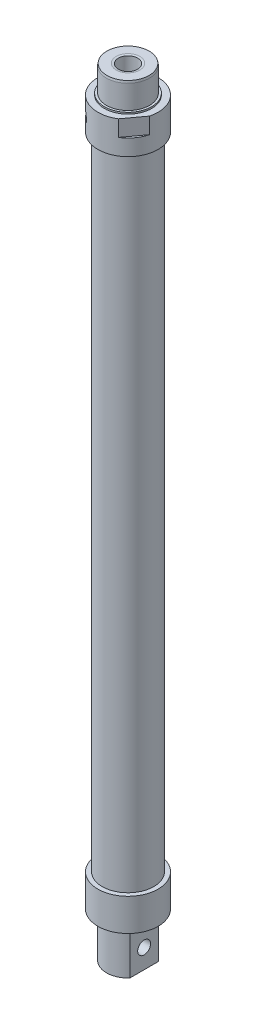
ISO-10303-21;
HEADER;
FILE_DESCRIPTION(('STEP AP214'),'2;1');
FILE_NAME('part.step','',(''),(''),'','','');
FILE_SCHEMA(('AUTOMOTIVE_DESIGN { 1 0 10303 214 1 1 1 1 }'));
ENDSEC;
DATA;
#1=APPLICATION_CONTEXT('core data for automotive mechanical design processes');
#2=APPLICATION_PROTOCOL_DEFINITION('international standard','automotive_design',2000,#1);
#3=PRODUCT_CONTEXT('',#1,'mechanical');
#4=PRODUCT('Part','Part','',(#3));
#5=PRODUCT_RELATED_PRODUCT_CATEGORY('part','',(#4));
#6=PRODUCT_DEFINITION_FORMATION('','',#4);
#7=PRODUCT_DEFINITION_CONTEXT('part definition',#1,'design');
#8=PRODUCT_DEFINITION('design','',#6,#7);
#9=PRODUCT_DEFINITION_SHAPE('','',#8);
#10=(LENGTH_UNIT() NAMED_UNIT(*) SI_UNIT(.MILLI.,.METRE.));
#11=(NAMED_UNIT(*) PLANE_ANGLE_UNIT() SI_UNIT($,.RADIAN.));
#12=(NAMED_UNIT(*) SI_UNIT($,.STERADIAN.) SOLID_ANGLE_UNIT());
#13=UNCERTAINTY_MEASURE_WITH_UNIT(LENGTH_MEASURE(1.E-05),#10,'distance_accuracy_value','');
#14=(GEOMETRIC_REPRESENTATION_CONTEXT(3) GLOBAL_UNCERTAINTY_ASSIGNED_CONTEXT((#13)) GLOBAL_UNIT_ASSIGNED_CONTEXT((#10,
#11,#12)) REPRESENTATION_CONTEXT('',''));
#15=CARTESIAN_POINT('',(0.,0.,0.));
#16=DIRECTION('',(0.,0.,1.));
#17=DIRECTION('',(1.,0.,0.));
#18=AXIS2_PLACEMENT_3D('',#15,#16,#17);
#19=CARTESIAN_POINT('',(0.,-35.75,0.));
#20=DIRECTION('',(0.,1.,0.));
#21=DIRECTION('',(0.,0.,1.));
#22=AXIS2_PLACEMENT_3D('',#19,#20,#21);
#23=CYLINDRICAL_SURFACE('',#22,10.);
#24=CARTESIAN_POINT('',(0.,-35.75,0.));
#25=DIRECTION('',(0.,-1.,0.));
#26=DIRECTION('',(0.,0.,-1.));
#27=AXIS2_PLACEMENT_3D('',#24,#25,#26);
#28=CIRCLE('',#27,10.);
#29=CARTESIAN_POINT('',(7.5,-35.75,6.61437827766148));
#30=VERTEX_POINT('',#29);
#31=CARTESIAN_POINT('',(-7.5,-35.75,6.61437827766148));
#32=VERTEX_POINT('',#31);
#33=EDGE_CURVE('E135',#30,#32,#28,.T.);
#34=ORIENTED_EDGE('',*,*,#33,.F.);
#35=DIRECTION('',(0.,-1.,0.));
#36=VECTOR('',#35,1.);
#37=CARTESIAN_POINT('',(7.5,-15.75,6.61437827766148));
#38=LINE('',#37,#36);
#39=CARTESIAN_POINT('',(7.5,-15.75,6.61437827766148));
#40=VERTEX_POINT('',#39);
#41=EDGE_CURVE('E120',#40,#30,#38,.T.);
#42=ORIENTED_EDGE('',*,*,#41,.F.);
#43=CARTESIAN_POINT('',(0.,-15.75,0.));
#44=DIRECTION('',(0.,-1.,0.));
#45=DIRECTION('',(0.,0.,-1.));
#46=AXIS2_PLACEMENT_3D('',#43,#44,#45);
#47=CIRCLE('',#46,10.);
#48=CARTESIAN_POINT('',(-7.5,-15.75,6.61437827766148));
#49=VERTEX_POINT('',#48);
#50=EDGE_CURVE('E145',#40,#49,#47,.T.);
#51=ORIENTED_EDGE('',*,*,#50,.T.);
#52=DIRECTION('',(0.,-1.,0.));
#53=VECTOR('',#52,1.);
#54=CARTESIAN_POINT('',(-7.5,-15.75,6.61437827766148));
#55=LINE('',#54,#53);
#56=EDGE_CURVE('E142',#49,#32,#55,.T.);
#57=ORIENTED_EDGE('',*,*,#56,.T.);
#58=EDGE_LOOP('',(#34,#42,#51,#57));
#59=FACE_BOUND('',#58,.T.);
#60=ADVANCED_FACE('F48',(#59),#23,.T.);
#61=CARTESIAN_POINT('',(-7.5,-15.75,-6.61437827766148));
#62=VERTEX_POINT('',#61);
#63=CARTESIAN_POINT('',(7.5,-15.75,-6.61437827766148));
#64=VERTEX_POINT('',#63);
#65=EDGE_CURVE('E130',#62,#64,#47,.T.);
#66=ORIENTED_EDGE('',*,*,#65,.T.);
#67=DIRECTION('',(0.,-1.,0.));
#68=VECTOR('',#67,1.);
#69=CARTESIAN_POINT('',(7.5,-15.75,-6.61437827766148));
#70=LINE('',#69,#68);
#71=CARTESIAN_POINT('',(7.5,-35.75,-6.61437827766148));
#72=VERTEX_POINT('',#71);
#73=EDGE_CURVE('E117',#64,#72,#70,.T.);
#74=ORIENTED_EDGE('',*,*,#73,.T.);
#75=CARTESIAN_POINT('',(-7.5,-35.75,-6.61437827766148));
#76=VERTEX_POINT('',#75);
#77=EDGE_CURVE('E129',#76,#72,#28,.T.);
#78=ORIENTED_EDGE('',*,*,#77,.F.);
#79=DIRECTION('',(0.,-1.,0.));
#80=VECTOR('',#79,1.);
#81=CARTESIAN_POINT('',(-7.5,-15.75,-6.61437827766148));
#82=LINE('',#81,#80);
#83=EDGE_CURVE('E71',#62,#76,#82,.T.);
#84=ORIENTED_EDGE('',*,*,#83,.F.);
#85=EDGE_LOOP('',(#66,#74,#78,#84));
#86=FACE_BOUND('',#85,.T.);
#87=ADVANCED_FACE('F128',(#86),#23,.T.);
#88=CARTESIAN_POINT('',(0.,-35.75,0.));
#89=DIRECTION('',(0.,-1.,0.));
#90=DIRECTION('',(0.,0.,-1.));
#91=AXIS2_PLACEMENT_3D('',#88,#89,#90);
#92=PLANE('',#91);
#93=DIRECTION('',(0.,0.,-1.));
#94=VECTOR('',#93,1.);
#95=CARTESIAN_POINT('',(7.5,-35.75,0.));
#96=LINE('',#95,#94);
#97=EDGE_CURVE('E114',#30,#72,#96,.T.);
#98=ORIENTED_EDGE('',*,*,#97,.F.);
#99=ORIENTED_EDGE('',*,*,#33,.T.);
#100=DIRECTION('',(0.,0.,-1.));
#101=VECTOR('',#100,1.);
#102=CARTESIAN_POINT('',(-7.5,-35.75,0.));
#103=LINE('',#102,#101);
#104=EDGE_CURVE('E124',#32,#76,#103,.T.);
#105=ORIENTED_EDGE('',*,*,#104,.T.);
#106=ORIENTED_EDGE('',*,*,#77,.T.);
#107=EDGE_LOOP('',(#98,#99,#105,#106));
#108=FACE_BOUND('',#107,.T.);
#109=ADVANCED_FACE('F133',(#108),#92,.T.);
#110=CARTESIAN_POINT('',(0.,-15.75,0.));
#111=DIRECTION('',(0.,-1.,0.));
#112=DIRECTION('',(0.,0.,-1.));
#113=AXIS2_PLACEMENT_3D('',#110,#111,#112);
#114=PLANE('',#113);
#115=CARTESIAN_POINT('',(0.,-15.75,0.));
#116=DIRECTION('',(0.,-1.,0.));
#117=DIRECTION('',(0.,0.,-1.));
#118=AXIS2_PLACEMENT_3D('',#115,#116,#117);
#119=CIRCLE('',#118,11.);
#120=CARTESIAN_POINT('',(0.,-15.75,-11.));
#121=VERTEX_POINT('',#120);
#122=EDGE_CURVE('E138',#121,#121,#119,.T.);
#123=ORIENTED_EDGE('',*,*,#122,.T.);
#124=EDGE_LOOP('',(#123));
#125=FACE_BOUND('',#124,.T.);
#126=ORIENTED_EDGE('',*,*,#65,.F.);
#127=DIRECTION('',(0.,0.,-1.));
#128=VECTOR('',#127,1.);
#129=CARTESIAN_POINT('',(-7.5,-15.75,0.));
#130=LINE('',#129,#128);
#131=EDGE_CURVE('E621',#49,#62,#130,.T.);
#132=ORIENTED_EDGE('',*,*,#131,.F.);
#133=ORIENTED_EDGE('',*,*,#50,.F.);
#134=DIRECTION('',(0.,0.,-1.));
#135=VECTOR('',#134,1.);
#136=CARTESIAN_POINT('',(7.5,-15.75,0.));
#137=LINE('',#136,#135);
#138=EDGE_CURVE('E63',#40,#64,#137,.T.);
#139=ORIENTED_EDGE('',*,*,#138,.T.);
#140=EDGE_LOOP('',(#126,#132,#133,#139));
#141=FACE_BOUND('',#140,.T.);
#142=ADVANCED_FACE('F240',(#125,#141),#114,.T.);
#143=CARTESIAN_POINT('',(0.,-15.,0.));
#144=DIRECTION('',(0.,-1.,0.));
#145=DIRECTION('',(0.,0.,-1.));
#146=AXIS2_PLACEMENT_3D('',#143,#144,#145);
#147=PLANE('',#146);
#148=CARTESIAN_POINT('',(0.,-15.,0.));
#149=DIRECTION('',(0.,-1.,0.));
#150=DIRECTION('',(0.,0.,-1.));
#151=AXIS2_PLACEMENT_3D('',#148,#149,#150);
#152=CIRCLE('',#151,14.);
#153=CARTESIAN_POINT('',(0.,-15.,-14.));
#154=VERTEX_POINT('',#153);
#155=EDGE_CURVE('E152',#154,#154,#152,.T.);
#156=ORIENTED_EDGE('',*,*,#155,.T.);
#157=EDGE_LOOP('',(#156));
#158=FACE_BOUND('',#157,.T.);
#159=CARTESIAN_POINT('',(0.,-15.,0.));
#160=DIRECTION('',(0.,-1.,0.));
#161=DIRECTION('',(0.,0.,-1.));
#162=AXIS2_PLACEMENT_3D('',#159,#160,#161);
#163=CIRCLE('',#162,11.);
#164=CARTESIAN_POINT('',(0.,-15.,-11.));
#165=VERTEX_POINT('',#164);
#166=EDGE_CURVE('E134',#165,#165,#163,.T.);
#167=ORIENTED_EDGE('',*,*,#166,.F.);
#168=EDGE_LOOP('',(#167));
#169=FACE_BOUND('',#168,.T.);
#170=ADVANCED_FACE('F243',(#158,#169),#147,.T.);
#171=CARTESIAN_POINT('',(0.,313.75,0.));
#172=DIRECTION('',(0.,1.,0.));
#173=DIRECTION('',(0.,0.,1.));
#174=AXIS2_PLACEMENT_3D('',#171,#172,#173);
#175=PLANE('',#174);
#176=CARTESIAN_POINT('',(0.,313.75,0.));
#177=DIRECTION('',(0.,1.,0.));
#178=DIRECTION('',(0.,0.,1.));
#179=AXIS2_PLACEMENT_3D('',#176,#177,#178);
#180=CIRCLE('',#179,11.);
#181=CARTESIAN_POINT('',(0.,313.75,11.));
#182=VERTEX_POINT('',#181);
#183=EDGE_CURVE('E164',#182,#182,#180,.T.);
#184=ORIENTED_EDGE('',*,*,#183,.T.);
#185=EDGE_LOOP('',(#184));
#186=FACE_BOUND('',#185,.T.);
#187=CARTESIAN_POINT('',(0.,313.75,0.));
#188=DIRECTION('',(0.,1.,0.));
#189=DIRECTION('',(0.,0.,1.));
#190=AXIS2_PLACEMENT_3D('',#187,#188,#189);
#191=CIRCLE('',#190,10.);
#192=CARTESIAN_POINT('',(0.,313.75,10.));
#193=VERTEX_POINT('',#192);
#194=EDGE_CURVE('E160',#193,#193,#191,.T.);
#195=ORIENTED_EDGE('',*,*,#194,.F.);
#196=EDGE_LOOP('',(#195));
#197=FACE_BOUND('',#196,.T.);
#198=ADVANCED_FACE('F257',(#186,#197),#175,.T.);
#199=CARTESIAN_POINT('',(0.,313.,0.));
#200=DIRECTION('',(0.,1.,0.));
#201=DIRECTION('',(0.,0.,1.));
#202=AXIS2_PLACEMENT_3D('',#199,#200,#201);
#203=PLANE('',#202);
#204=CARTESIAN_POINT('',(0.,313.,0.));
#205=DIRECTION('',(0.,1.,0.));
#206=DIRECTION('',(0.,0.,1.));
#207=AXIS2_PLACEMENT_3D('',#204,#205,#206);
#208=CIRCLE('',#207,14.);
#209=CARTESIAN_POINT('',(13.5559690652132,313.,3.49795693269422));
#210=VERTEX_POINT('',#209);
#211=CARTESIAN_POINT('',(-7.41007017913965,313.,-11.8781673645485));
#212=VERTEX_POINT('',#211);
#213=EDGE_CURVE('E315',#210,#212,#208,.T.);
#214=ORIENTED_EDGE('',*,*,#213,.T.);
#215=DIRECTION('',(0.591389396047797,0.,-0.8063861247828));
#216=VECTOR('',#215,1.);
#217=CARTESIAN_POINT('',(-14.0313559984632,313.,-2.84974539992456));
#218=LINE('',#217,#216);
#219=CARTESIAN_POINT('',(-13.5559690652132,313.,-3.49795693269422));
#220=VERTEX_POINT('',#219);
#221=EDGE_CURVE('E180',#220,#212,#218,.T.);
#222=ORIENTED_EDGE('',*,*,#221,.F.);
#223=CARTESIAN_POINT('',(7.41007017913965,313.,11.8781673645485));
#224=VERTEX_POINT('',#223);
#225=EDGE_CURVE('E319',#220,#224,#208,.T.);
#226=ORIENTED_EDGE('',*,*,#225,.T.);
#227=DIRECTION('',(0.591389396047797,0.,-0.8063861247828));
#228=VECTOR('',#227,1.);
#229=CARTESIAN_POINT('',(6.93468324588963,313.,12.5263788973182));
#230=LINE('',#229,#228);
#231=EDGE_CURVE('E320',#224,#210,#230,.T.);
#232=ORIENTED_EDGE('',*,*,#231,.T.);
#233=EDGE_LOOP('',(#214,#222,#226,#232));
#234=FACE_BOUND('',#233,.T.);
#235=CARTESIAN_POINT('',(0.,313.,0.));
#236=DIRECTION('',(0.,1.,0.));
#237=DIRECTION('',(0.,0.,1.));
#238=AXIS2_PLACEMENT_3D('',#235,#236,#237);
#239=CIRCLE('',#238,11.);
#240=CARTESIAN_POINT('',(0.,313.,11.));
#241=VERTEX_POINT('',#240);
#242=EDGE_CURVE('E163',#241,#241,#239,.T.);
#243=ORIENTED_EDGE('',*,*,#242,.F.);
#244=EDGE_LOOP('',(#243));
#245=FACE_BOUND('',#244,.T.);
#246=ADVANCED_FACE('F275',(#234,#245),#203,.T.);
#247=CARTESIAN_POINT('',(0.,313.,0.));
#248=DIRECTION('',(0.,-1.,0.));
#249=DIRECTION('',(0.,0.,-1.));
#250=AXIS2_PLACEMENT_3D('',#247,#248,#249);
#251=CYLINDRICAL_SURFACE('',#250,14.);
#252=CARTESIAN_POINT('',(-7.56557871726426,305.,11.779729142594));
#253=CARTESIAN_POINT('',(-7.56558449976278,304.860780366988,11.7797273395646));
#254=CARTESIAN_POINT('',(-7.57556798166909,304.72148845813,11.773331907971));
#255=CARTESIAN_POINT('',(-7.61509376766525,304.446823734586,11.7478031747569));
#256=CARTESIAN_POINT('',(-7.64465330240507,304.311454482243,11.7286586514282));
#257=CARTESIAN_POINT('',(-7.7220424960355,304.048649339364,11.677850278003));
#258=CARTESIAN_POINT('',(-7.76985591137609,303.92120651227,11.6461975576786));
#259=CARTESIAN_POINT('',(-7.88181289564474,303.677628912188,11.5707200577548));
#260=CARTESIAN_POINT('',(-7.9459549422365,303.56149308643,11.5268964128295));
#261=CARTESIAN_POINT('',(-8.08885371918934,303.342503072222,11.4270773506191));
#262=CARTESIAN_POINT('',(-8.16775177683242,303.239795182935,11.3709632467704));
#263=CARTESIAN_POINT('',(-8.3368400607666,303.051849471074,11.2475788875549));
#264=CARTESIAN_POINT('',(-8.42703099526362,302.966612745048,11.1803079324268));
#265=CARTESIAN_POINT('',(-8.61620579924658,302.815473289733,11.0351839579137));
#266=CARTESIAN_POINT('',(-8.71524593766637,302.749707728863,10.9572612635881));
#267=CARTESIAN_POINT('',(-8.91819151517876,302.640260257314,10.7927245663869));
#268=CARTESIAN_POINT('',(-9.02209659080563,302.596576699729,10.7061112122507));
#269=CARTESIAN_POINT('',(-9.23023720859617,302.532983509955,10.5271719340805));
#270=CARTESIAN_POINT('',(-9.33445766166396,302.512827582957,10.4349160308028));
#271=CARTESIAN_POINT('',(-9.54108308930762,302.496095072754,10.2463305795848));
#272=CARTESIAN_POINT('',(-9.64348820407191,302.499516660767,10.1500013481668));
#273=CARTESIAN_POINT('',(-9.8423997487348,302.529651754197,9.95721558881833));
#274=CARTESIAN_POINT('',(-9.93895998737446,302.556100123599,9.86077294796596));
#275=CARTESIAN_POINT('',(-10.1249835208226,302.631119487911,9.66966921044279));
#276=CARTESIAN_POINT('',(-10.2144465750899,302.679691232261,9.57500817423782));
#277=CARTESIAN_POINT('',(-10.3847220242253,302.797835985916,9.39007167304677));
#278=CARTESIAN_POINT('',(-10.4654872345181,302.867516422082,9.29982145053939));
#279=CARTESIAN_POINT('',(-10.616276603899,303.025821638939,9.12731162735837));
#280=CARTESIAN_POINT('',(-10.6862997678186,303.114448173023,9.045052767282));
#281=CARTESIAN_POINT('',(-10.8153247411407,303.309595111988,8.89039107913933));
#282=CARTESIAN_POINT('',(-10.874159597833,303.416347387838,8.8181413554389));
#283=CARTESIAN_POINT('',(-10.9786804270314,303.643939208173,8.68766861899324));
#284=CARTESIAN_POINT('',(-11.0243662407899,303.764778922711,8.62944577559514));
#285=CARTESIAN_POINT('',(-11.1019926029124,304.017399047897,8.52934918166979));
#286=CARTESIAN_POINT('',(-11.1339134393036,304.149194828246,8.48749888515274));
#287=CARTESIAN_POINT('',(-11.1834607772783,304.419825812411,8.42210809186018));
#288=CARTESIAN_POINT('',(-11.2010887371806,304.558660296524,8.39856572711513));
#289=CARTESIAN_POINT('',(-11.2216622130591,304.837392095441,8.37105680210378));
#290=CARTESIAN_POINT('',(-11.2248054084444,304.97724884695,8.36682668726938));
#291=CARTESIAN_POINT('',(-11.2169037628631,305.255830337016,8.37741678699205));
#292=CARTESIAN_POINT('',(-11.2058595550487,305.394555125812,8.39223615141335));
#293=CARTESIAN_POINT('',(-11.1698728637777,305.665884582268,8.44007203760068));
#294=CARTESIAN_POINT('',(-11.1450336953017,305.798526902607,8.47295326837338));
#295=CARTESIAN_POINT('',(-11.0818665370105,306.055127312204,8.55540267355273));
#296=CARTESIAN_POINT('',(-11.0435376346163,306.179084813255,8.60497197689559));
#297=CARTESIAN_POINT('',(-10.9534363280735,306.416232126468,8.71937899651248));
#298=CARTESIAN_POINT('',(-10.9015267064847,306.529294908469,8.78437188854552));
#299=CARTESIAN_POINT('',(-10.7852060597819,306.740124255166,8.92680034623781));
#300=CARTESIAN_POINT('',(-10.7207940194924,306.837889576567,9.00423692221549));
#301=CARTESIAN_POINT('',(-10.5796368586623,307.016548314716,9.16969070901586));
#302=CARTESIAN_POINT('',(-10.5027525840427,307.097224419615,9.25782408621323));
#303=CARTESIAN_POINT('',(-10.3386468294686,307.237886062422,9.44073389278476));
#304=CARTESIAN_POINT('',(-10.2514257207208,307.297872343022,9.53551008355843));
#305=CARTESIAN_POINT('',(-10.0689812147423,307.395120518557,9.72795436472244));
#306=CARTESIAN_POINT('',(-9.97379908044092,307.432492216579,9.82560602754441));
#307=CARTESIAN_POINT('',(-9.77743300131784,307.48380228348,10.0210267159878));
#308=CARTESIAN_POINT('',(-9.67624962775869,307.497742879091,10.1187957295733));
#309=CARTESIAN_POINT('',(-9.47213340092922,307.501723426947,10.3100914420891));
#310=CARTESIAN_POINT('',(-9.36924436588339,307.492092651136,10.4036582027941));
#311=CARTESIAN_POINT('',(-9.16340969566385,307.449921033261,10.5854040305628));
#312=CARTESIAN_POINT('',(-9.06046406093401,307.417380368374,10.6735831392868));
#313=CARTESIAN_POINT('',(-8.85787650659482,307.330446063029,10.8422963755492));
#314=CARTESIAN_POINT('',(-8.75822998614844,307.276084374272,10.9228414690535));
#315=CARTESIAN_POINT('',(-8.56529186986448,307.147089306889,11.0747854600691));
#316=CARTESIAN_POINT('',(-8.47200064622809,307.072454742247,11.1461838221128));
#317=CARTESIAN_POINT('',(-8.29372628117048,306.903884011287,11.2794801181941));
#318=CARTESIAN_POINT('',(-8.20886756456692,306.809708481173,11.3412417889735));
#319=CARTESIAN_POINT('',(-8.05187359732967,306.605228628036,11.4532377373901));
#320=CARTESIAN_POINT('',(-7.97974133550728,306.49492052737,11.5034693080116));
#321=CARTESIAN_POINT('',(-7.85040209312575,306.260218838816,11.5921268037203));
#322=CARTESIAN_POINT('',(-7.7933234265258,306.13571634738,11.6304517009731));
#323=CARTESIAN_POINT('',(-7.69725098232093,305.876924932344,11.6942584671183));
#324=CARTESIAN_POINT('',(-7.65823969164099,305.742645632362,11.7197527750489));
#325=CARTESIAN_POINT('',(-7.6080675665349,305.506593264787,11.7523577900871));
#326=CARTESIAN_POINT('',(-7.59217017289351,305.406224134088,11.7626150430059));
#327=CARTESIAN_POINT('',(-7.57092375135002,305.203916238032,11.7763013013423));
#328=CARTESIAN_POINT('',(-7.56557448162034,305.101977508713,11.7797304633017));
#329=CARTESIAN_POINT('',(-7.56557871726426,305.,11.779729142594));
#330=B_SPLINE_CURVE_WITH_KNOTS('',3,(#252,#253,#254,#255,#256,#257,#258,#259,#260,#261,#262,
#263,#264,#265,#266,#267,#268,#269,#270,#271,#272,#273,#274,#275,#276,#277,#278,#279,#280,#281,
#282,#283,#284,#285,#286,#287,#288,#289,#290,#291,#292,#293,#294,#295,#296,#297,#298,#299,#300,
#301,#302,#303,#304,#305,#306,#307,#308,#309,#310,#311,#312,#313,#314,#315,#316,#317,#318,#319,
#320,#321,#322,#323,#324,#325,#326,#327,#328,#329),.UNSPECIFIED.,.T.,.F.,(4,2,2,2,2,2,2,2,2,2,2,
2,2,2,2,2,2,2,2,2,2,2,2,2,2,2,2,2,2,2,2,2,2,2,2,2,2,2,4),(0.,0.417285836009358,
0.834939451951101,1.25222227420762,1.66946620696477,2.09093251520218,2.51242526794803,
2.93682027279783,3.36118362098871,3.78106358503938,4.20091098159998,4.61598714610607,
5.0310773725628,5.44831662439178,5.86559450693792,6.28867984623354,6.7117702932007,
7.13546462585334,7.55911572303871,7.97696761802826,8.39480086586733,8.80954621973394,
9.22431963646759,9.64345757488935,10.0626295608598,10.4868484189542,10.9110520475065,
11.3331791121112,11.7552660584074,12.171490547398,12.5877118174954,13.0033258408441,
13.4189641839516,13.8400311188066,14.2611968100939,14.6858441972249,15.1100790990291,
15.4157453666602,15.7214046264677),.UNSPECIFIED.);
#331=CARTESIAN_POINT('',(-7.56557871726426,305.,11.779729142594));
#332=VERTEX_POINT('',#331);
#333=EDGE_CURVE('E173',#332,#332,#330,.T.);
#334=ORIENTED_EDGE('',*,*,#333,.T.);
#335=EDGE_LOOP('',(#334));
#336=FACE_BOUND('',#335,.T.);
#337=CARTESIAN_POINT('',(0.,298.,0.));
#338=DIRECTION('',(0.,1.,0.));
#339=DIRECTION('',(0.,0.,1.));
#340=AXIS2_PLACEMENT_3D('',#337,#338,#339);
#341=CIRCLE('',#340,14.);
#342=CARTESIAN_POINT('',(0.,298.,14.));
#343=VERTEX_POINT('',#342);
#344=EDGE_CURVE('E316',#343,#343,#341,.T.);
#345=ORIENTED_EDGE('',*,*,#344,.T.);
#346=EDGE_LOOP('',(#345));
#347=FACE_BOUND('',#346,.T.);
#348=CARTESIAN_POINT('',(0.,305.5,0.));
#349=DIRECTION('',(0.,1.,0.));
#350=DIRECTION('',(0.,0.,1.));
#351=AXIS2_PLACEMENT_3D('',#348,#349,#350);
#352=CIRCLE('',#351,14.);
#353=CARTESIAN_POINT('',(-7.41007017913965,305.5,-11.8781673645485));
#354=VERTEX_POINT('',#353);
#355=CARTESIAN_POINT('',(-13.5559690652132,305.5,-3.49795693269423));
#356=VERTEX_POINT('',#355);
#357=EDGE_CURVE('E299',#354,#356,#352,.T.);
#358=ORIENTED_EDGE('',*,*,#357,.F.);
#359=DIRECTION('',(0.,-1.,0.));
#360=VECTOR('',#359,1.);
#361=CARTESIAN_POINT('',(-7.41007017913965,313.,-11.8781673645485));
#362=LINE('',#361,#360);
#363=EDGE_CURVE('E204',#212,#354,#362,.T.);
#364=ORIENTED_EDGE('',*,*,#363,.F.);
#365=ORIENTED_EDGE('',*,*,#213,.F.);
#366=DIRECTION('',(0.,-1.,0.));
#367=VECTOR('',#366,1.);
#368=CARTESIAN_POINT('',(13.5559690652132,313.,3.49795693269422));
#369=LINE('',#368,#367);
#370=CARTESIAN_POINT('',(13.5559690652132,305.5,3.49795693269422));
#371=VERTEX_POINT('',#370);
#372=EDGE_CURVE('E303',#371,#210,#369,.F.);
#373=ORIENTED_EDGE('',*,*,#372,.F.);
#374=CARTESIAN_POINT('',(0.,305.5,0.));
#375=DIRECTION('',(0.,-1.,0.));
#376=DIRECTION('',(0.,0.,-1.));
#377=AXIS2_PLACEMENT_3D('',#374,#375,#376);
#378=CIRCLE('',#377,14.);
#379=CARTESIAN_POINT('',(7.41007017913965,305.5,11.8781673645485));
#380=VERTEX_POINT('',#379);
#381=EDGE_CURVE('E309',#371,#380,#378,.T.);
#382=ORIENTED_EDGE('',*,*,#381,.T.);
#383=DIRECTION('',(0.,-1.,0.));
#384=VECTOR('',#383,1.);
#385=CARTESIAN_POINT('',(7.41007017913965,313.,11.8781673645485));
#386=LINE('',#385,#384);
#387=EDGE_CURVE('E307',#224,#380,#386,.T.);
#388=ORIENTED_EDGE('',*,*,#387,.F.);
#389=ORIENTED_EDGE('',*,*,#225,.F.);
#390=DIRECTION('',(0.,-1.,0.));
#391=VECTOR('',#390,1.);
#392=CARTESIAN_POINT('',(-13.5559690652132,313.,-3.49795693269422));
#393=LINE('',#392,#391);
#394=EDGE_CURVE('E295',#356,#220,#393,.F.);
#395=ORIENTED_EDGE('',*,*,#394,.F.);
#396=EDGE_LOOP('',(#358,#364,#365,#373,#382,#388,#389,#395));
#397=FACE_BOUND('',#396,.T.);
#398=ADVANCED_FACE('F182',(#336,#347,#397),#251,.T.);
#399=CARTESIAN_POINT('',(0.,298.,0.));
#400=DIRECTION('',(0.,-1.,0.));
#401=DIRECTION('',(0.,0.,-1.));
#402=AXIS2_PLACEMENT_3D('',#399,#400,#401);
#403=CYLINDRICAL_SURFACE('',#402,12.);
#404=CARTESIAN_POINT('',(0.,298.,0.));
#405=DIRECTION('',(0.,1.,0.));
#406=DIRECTION('',(0.,0.,1.));
#407=AXIS2_PLACEMENT_3D('',#404,#405,#406);
#408=CIRCLE('',#407,12.);
#409=CARTESIAN_POINT('',(0.,298.,12.));
#410=VERTEX_POINT('',#409);
#411=EDGE_CURVE('E312',#410,#410,#408,.T.);
#412=ORIENTED_EDGE('',*,*,#411,.F.);
#413=EDGE_LOOP('',(#412));
#414=FACE_BOUND('',#413,.T.);
#415=CARTESIAN_POINT('',(0.,0.,0.));
#416=DIRECTION('',(0.,-1.,0.));
#417=DIRECTION('',(0.,0.,-1.));
#418=AXIS2_PLACEMENT_3D('',#415,#416,#417);
#419=CIRCLE('',#418,12.);
#420=CARTESIAN_POINT('',(0.,0.,-12.));
#421=VERTEX_POINT('',#420);
#422=EDGE_CURVE('E155',#421,#421,#419,.T.);
#423=ORIENTED_EDGE('',*,*,#422,.F.);
#424=EDGE_LOOP('',(#423));
#425=FACE_BOUND('',#424,.T.);
#426=ADVANCED_FACE('F213',(#414,#425),#403,.T.);
#427=CARTESIAN_POINT('',(0.,298.,0.));
#428=DIRECTION('',(0.,-1.,0.));
#429=DIRECTION('',(0.,0.,-1.));
#430=AXIS2_PLACEMENT_3D('',#427,#428,#429);
#431=CYLINDRICAL_SURFACE('',#430,10.);
#432=CARTESIAN_POINT('',(-4.77462699645912,305.,8.78652018973858));
#433=CARTESIAN_POINT('',(-4.77463166174064,304.861949249073,8.78651944294324));
#434=CARTESIAN_POINT('',(-4.78505418906189,304.723855101321,8.78087846138424));
#435=CARTESIAN_POINT('',(-4.82622862878412,304.451632421827,8.7583131554792));
#436=CARTESIAN_POINT('',(-4.85699237272494,304.317506245532,8.74138226426898));
#437=CARTESIAN_POINT('',(-4.93728840423852,304.057196461813,8.69627996740197));
#438=CARTESIAN_POINT('',(-4.9867964613014,303.931002844614,8.66812307096211));
#439=CARTESIAN_POINT('',(-5.10235225166275,303.68968914746,8.60060815773557));
#440=CARTESIAN_POINT('',(-5.1684006871547,303.57456953792,8.56124966539462));
#441=CARTESIAN_POINT('',(-5.31579293150925,303.356138354738,8.47053492353004));
#442=CARTESIAN_POINT('',(-5.39741422783943,303.25310639965,8.41895610992313));
#443=CARTESIAN_POINT('',(-5.57188877536206,303.06423860564,8.30451217943043));
#444=CARTESIAN_POINT('',(-5.6647430753273,302.978404374378,8.24164600843138));
#445=CARTESIAN_POINT('',(-5.85965154412051,302.825224532369,8.10425044154015));
#446=CARTESIAN_POINT('',(-5.96181600372105,302.758153611839,8.02957054416809));
#447=CARTESIAN_POINT('',(-6.17050647753339,302.646190355847,7.87032729270543));
#448=CARTESIAN_POINT('',(-6.27703184571376,302.601294748084,7.78576539913075));
#449=CARTESIAN_POINT('',(-6.48853998706001,302.535852165421,7.61034397764733));
#450=CARTESIAN_POINT('',(-6.59351029294534,302.514830355673,7.51964673235027));
#451=CARTESIAN_POINT('',(-6.80065882725227,302.496241620724,7.33283567239196));
#452=CARTESIAN_POINT('',(-6.90283746623358,302.49867122779,7.23672266064316));
#453=CARTESIAN_POINT('',(-7.09918474820181,302.52657485025,7.0441520581131));
#454=CARTESIAN_POINT('',(-7.19348081896134,302.551536325054,6.94774943699061));
#455=CARTESIAN_POINT('',(-7.37424310893381,302.622971270048,6.75558663726427));
#456=CARTESIAN_POINT('',(-7.46070891105095,302.669445885377,6.65982649313457));
#457=CARTESIAN_POINT('',(-7.62484524000932,302.783002570687,6.47128379895274));
#458=CARTESIAN_POINT('',(-7.70242923829276,302.850267044662,6.37853597072472));
#459=CARTESIAN_POINT('',(-7.84672602464028,303.003355679116,6.20016708719589));
#460=CARTESIAN_POINT('',(-7.91343691781499,303.089183068561,6.11454727538557));
#461=CARTESIAN_POINT('',(-8.03689764159989,303.279708741982,5.95138972784266));
#462=CARTESIAN_POINT('',(-8.09332901375178,303.384854892348,5.87413344712695));
#463=CARTESIAN_POINT('',(-8.19346224809248,303.60959997354,5.73364111998446));
#464=CARTESIAN_POINT('',(-8.23716351533024,303.729199579491,5.67040572886751));
#465=CARTESIAN_POINT('',(-8.31171890261557,303.980290034149,5.56055554012705));
#466=CARTESIAN_POINT('',(-8.34250970061482,304.111835730313,5.51402282090447));
#467=CARTESIAN_POINT('',(-8.39072599026923,304.382585468077,5.44037462320378));
#468=CARTESIAN_POINT('',(-8.40815434204356,304.521787863985,5.41325498960054));
#469=CARTESIAN_POINT('',(-8.4292511594668,304.79995950153,5.38034385766409));
#470=CARTESIAN_POINT('',(-8.43327089544043,304.938837793341,5.37400795582136));
#471=CARTESIAN_POINT('',(-8.42850925001253,305.215821936585,5.38147298769719));
#472=CARTESIAN_POINT('',(-8.41972904699985,305.353927857949,5.39527206774782));
#473=CARTESIAN_POINT('',(-8.38968000281336,305.623114264949,5.44187553409767));
#474=CARTESIAN_POINT('',(-8.36861784541139,305.754272726569,5.4743652703677));
#475=CARTESIAN_POINT('',(-8.31430135913211,306.008431457853,5.55650989140013));
#476=CARTESIAN_POINT('',(-8.28104558596643,306.131430759056,5.60616680951146));
#477=CARTESIAN_POINT('',(-8.20176797529603,306.368441277867,5.72153632210949));
#478=CARTESIAN_POINT('',(-8.15550850130731,306.482228840043,5.78754477433428));
#479=CARTESIAN_POINT('',(-8.0508313652782,306.695188362802,5.93229089547488));
#480=CARTESIAN_POINT('',(-7.99241170497467,306.79435791665,6.01103065603004));
#481=CARTESIAN_POINT('',(-7.86231035699781,306.977811042571,6.18026928224542));
#482=CARTESIAN_POINT('',(-7.79033341129087,307.061660062549,6.27101307930401));
#483=CARTESIAN_POINT('',(-7.63505947861219,307.208935866951,6.45915794070894));
#484=CARTESIAN_POINT('',(-7.55176308242099,307.272363716608,6.55655865748802));
#485=CARTESIAN_POINT('',(-7.37596675002784,307.376446034528,6.75369615742085));
#486=CARTESIAN_POINT('',(-7.28353887558895,307.417264284379,6.85341053905211));
#487=CARTESIAN_POINT('',(-7.09109114452645,307.475460334608,7.05234408970331));
#488=CARTESIAN_POINT('',(-6.99107275701054,307.492842658739,7.15156335060972));
#489=CARTESIAN_POINT('',(-6.78898870759695,307.503418973939,7.34360550446546));
#490=CARTESIAN_POINT('',(-6.68705152221495,307.497254272738,7.43652880831653));
#491=CARTESIAN_POINT('',(-6.48164074108181,307.462380431764,7.61622987822101));
#492=CARTESIAN_POINT('',(-6.37816719111367,307.433671962467,7.70300782696051));
#493=CARTESIAN_POINT('',(-6.17353525728877,307.354869450573,7.8679512303656));
#494=CARTESIAN_POINT('',(-6.07236740875303,307.304891366714,7.9461605344941));
#495=CARTESIAN_POINT('',(-5.87506179621655,307.185073552451,8.09313294748271));
#496=CARTESIAN_POINT('',(-5.77892466810905,307.115231318324,8.16189486395105));
#497=CARTESIAN_POINT('',(-5.59270100397696,306.95571191501,8.29064711131091));
#498=CARTESIAN_POINT('',(-5.50281460043282,306.86559964274,8.35038783432487));
#499=CARTESIAN_POINT('',(-5.33498111400351,306.668942870057,8.45860333301739));
#500=CARTESIAN_POINT('',(-5.25703706361554,306.562394209722,8.50707524884205));
#501=CARTESIAN_POINT('',(-5.11486222310642,306.333496464526,8.5933255716295));
#502=CARTESIAN_POINT('',(-5.05091439462643,306.210889691587,8.63088761083326));
#503=CARTESIAN_POINT('',(-4.94153316555292,305.954861275313,8.69397867184343));
#504=CARTESIAN_POINT('',(-4.89608629591374,305.821447584765,8.71951644966693));
#505=CARTESIAN_POINT('',(-4.83253732998167,305.573557470412,8.7548632510787));
#506=CARTESIAN_POINT('',(-4.81089063560393,305.460267089035,8.7667326807578));
#507=CARTESIAN_POINT('',(-4.78193412569514,305.231327827506,8.78256112558849));
#508=CARTESIAN_POINT('',(-4.77462308720261,305.115679149389,8.78652081551316));
#509=CARTESIAN_POINT('',(-4.77462699645912,305.,8.78652018973858));
#510=B_SPLINE_CURVE_WITH_KNOTS('',3,(#432,#433,#434,#435,#436,#437,#438,#439,#440,#441,#442,
#443,#444,#445,#446,#447,#448,#449,#450,#451,#452,#453,#454,#455,#456,#457,#458,#459,#460,#461,
#462,#463,#464,#465,#466,#467,#468,#469,#470,#471,#472,#473,#474,#475,#476,#477,#478,#479,#480,
#481,#482,#483,#484,#485,#486,#487,#488,#489,#490,#491,#492,#493,#494,#495,#496,#497,#498,#499,
#500,#501,#502,#503,#504,#505,#506,#507,#508,#509),.UNSPECIFIED.,.T.,.F.,(4,2,2,2,2,2,2,2,2,2,2,
2,2,2,2,2,2,2,2,2,2,2,2,2,2,2,2,2,2,2,2,2,2,2,2,2,2,2,4),(0.,0.413727441736122,
0.827695741428655,1.24113072716602,1.65458326755477,2.07623954192976,2.49793521479865,
2.92551496397919,3.35303159847091,3.77188750995348,4.19068148666023,4.6001826268895,
5.00970556724789,5.42292874254442,5.83622385468914,6.26070466571911,6.68520531199805,
7.11176432008403,7.53823200129545,7.95343574764202,8.36860127188744,8.77697405014149,
9.1853952142636,9.60182845864105,10.0183301889,10.4452533097027,10.872154157245,
11.2959207281187,11.7196054891398,12.131834461324,12.5440511738193,12.9540487656466,
13.3640980574302,13.7839709658701,14.2039503157046,14.6317647729113,15.0592672137502,
15.4059782718572,15.7526597510792),.UNSPECIFIED.);
#511=CARTESIAN_POINT('',(-4.77462699645912,305.,8.78652018973858));
#512=VERTEX_POINT('',#511);
#513=EDGE_CURVE('E172',#512,#512,#510,.T.);
#514=ORIENTED_EDGE('',*,*,#513,.F.);
#515=EDGE_LOOP('',(#514));
#516=FACE_BOUND('',#515,.T.);
#517=CARTESIAN_POINT('',(0.,313.,0.));
#518=DIRECTION('',(0.,1.,0.));
#519=DIRECTION('',(0.,0.,1.));
#520=AXIS2_PLACEMENT_3D('',#517,#518,#519);
#521=CIRCLE('',#520,10.);
#522=CARTESIAN_POINT('',(0.,313.,10.));
#523=VERTEX_POINT('',#522);
#524=EDGE_CURVE('E167',#523,#523,#521,.T.);
#525=ORIENTED_EDGE('',*,*,#524,.T.);
#526=EDGE_LOOP('',(#525));
#527=FACE_BOUND('',#526,.T.);
#528=CARTESIAN_POINT('',(0.,-15.,0.));
#529=DIRECTION('',(0.,-1.,0.));
#530=DIRECTION('',(0.,0.,-1.));
#531=AXIS2_PLACEMENT_3D('',#528,#529,#530);
#532=CIRCLE('',#531,10.);
#533=CARTESIAN_POINT('',(0.,-15.,-10.));
#534=VERTEX_POINT('',#533);
#535=EDGE_CURVE('E147',#534,#534,#532,.T.);
#536=ORIENTED_EDGE('',*,*,#535,.T.);
#537=EDGE_LOOP('',(#536));
#538=FACE_BOUND('',#537,.T.);
#539=ADVANCED_FACE('F208',(#516,#527,#538),#431,.F.);
#540=CARTESIAN_POINT('',(0.,298.,0.));
#541=DIRECTION('',(0.,1.,0.));
#542=DIRECTION('',(0.,0.,1.));
#543=AXIS2_PLACEMENT_3D('',#540,#541,#542);
#544=PLANE('',#543);
#545=ORIENTED_EDGE('',*,*,#344,.F.);
#546=EDGE_LOOP('',(#545));
#547=FACE_BOUND('',#546,.T.);
#548=ORIENTED_EDGE('',*,*,#411,.T.);
#549=EDGE_LOOP('',(#548));
#550=FACE_BOUND('',#549,.T.);
#551=ADVANCED_FACE('F212',(#547,#550),#544,.F.);
#552=CARTESIAN_POINT('',(6.93468324588963,305.5,12.5263788973182));
#553=DIRECTION('',(0.,-1.,0.));
#554=DIRECTION('',(0.,0.,-1.));
#555=AXIS2_PLACEMENT_3D('',#552,#553,#554);
#556=PLANE('',#555);
#557=DIRECTION('',(0.591389396047797,0.,-0.8063861247828));
#558=VECTOR('',#557,1.);
#559=CARTESIAN_POINT('',(6.93468324588963,305.5,12.5263788973182));
#560=LINE('',#559,#558);
#561=EDGE_CURVE('E325',#380,#371,#560,.T.);
#562=ORIENTED_EDGE('',*,*,#561,.F.);
#563=ORIENTED_EDGE('',*,*,#381,.F.);
#564=EDGE_LOOP('',(#562,#563));
#565=FACE_BOUND('',#564,.T.);
#566=ADVANCED_FACE('F341',(#565),#556,.F.);
#567=CARTESIAN_POINT('',(10.4830196221764,0.,7.68806214862138));
#568=DIRECTION('',(0.8063861247828,0.,0.591389396047797));
#569=DIRECTION('',(0.591389396047797,0.,-0.8063861247828));
#570=AXIS2_PLACEMENT_3D('',#567,#568,#569);
#571=PLANE('',#570);
#572=ORIENTED_EDGE('',*,*,#387,.T.);
#573=ORIENTED_EDGE('',*,*,#561,.T.);
#574=ORIENTED_EDGE('',*,*,#372,.T.);
#575=ORIENTED_EDGE('',*,*,#231,.F.);
#576=EDGE_LOOP('',(#572,#573,#574,#575));
#577=FACE_BOUND('',#576,.T.);
#578=ADVANCED_FACE('F338',(#577),#571,.T.);
#579=CARTESIAN_POINT('',(-14.0313559984632,305.5,-2.84974539992456));
#580=DIRECTION('',(0.,1.,0.));
#581=DIRECTION('',(0.,0.,1.));
#582=AXIS2_PLACEMENT_3D('',#579,#580,#581);
#583=PLANE('',#582);
#584=DIRECTION('',(0.591389396047797,0.,-0.806386124782801));
#585=VECTOR('',#584,1.);
#586=CARTESIAN_POINT('',(-14.0313559984632,305.5,-2.84974539992456));
#587=LINE('',#586,#585);
#588=EDGE_CURVE('E327',#356,#354,#587,.T.);
#589=ORIENTED_EDGE('',*,*,#588,.T.);
#590=ORIENTED_EDGE('',*,*,#357,.T.);
#591=EDGE_LOOP('',(#589,#590));
#592=FACE_BOUND('',#591,.T.);
#593=ADVANCED_FACE('F348',(#592),#583,.T.);
#594=CARTESIAN_POINT('',(-10.4830196221764,0.,-7.68806214862138));
#595=DIRECTION('',(-0.8063861247828,0.,-0.591389396047797));
#596=DIRECTION('',(0.591389396047797,0.,-0.806386124782801));
#597=AXIS2_PLACEMENT_3D('',#594,#595,#596);
#598=PLANE('',#597);
#599=ORIENTED_EDGE('',*,*,#363,.T.);
#600=ORIENTED_EDGE('',*,*,#588,.F.);
#601=ORIENTED_EDGE('',*,*,#394,.T.);
#602=ORIENTED_EDGE('',*,*,#221,.T.);
#603=EDGE_LOOP('',(#599,#600,#601,#602));
#604=FACE_BOUND('',#603,.T.);
#605=ADVANCED_FACE('F192',(#604),#598,.T.);
#606=CARTESIAN_POINT('',(-6.13767848205985,305.,6.58246935814057));
#607=DIRECTION('',(-0.681964275784428,0.,0.731385484237841));
#608=DIRECTION('',(0.731385484237841,0.,0.681964275784428));
#609=AXIS2_PLACEMENT_3D('',#606,#607,#608);
#610=CYLINDRICAL_SURFACE('',#609,2.5);
#611=ORIENTED_EDGE('',*,*,#513,.T.);
#612=EDGE_LOOP('',(#611));
#613=FACE_BOUND('',#612,.T.);
#614=ORIENTED_EDGE('',*,*,#333,.F.);
#615=EDGE_LOOP('',(#614));
#616=FACE_BOUND('',#615,.T.);
#617=ADVANCED_FACE('F186',(#613,#616),#610,.F.);
#618=CARTESIAN_POINT('',(0.,313.,0.));
#619=DIRECTION('',(0.,1.,0.));
#620=DIRECTION('',(0.,0.,1.));
#621=AXIS2_PLACEMENT_3D('',#618,#619,#620);
#622=PLANE('',#621);
#623=CARTESIAN_POINT('',(0.,313.,0.));
#624=DIRECTION('',(0.,1.,0.));
#625=DIRECTION('',(0.,0.,1.));
#626=AXIS2_PLACEMENT_3D('',#623,#624,#625);
#627=CIRCLE('',#626,4.67632698070845);
#628=CARTESIAN_POINT('',(0.,313.,4.67632698070845));
#629=VERTEX_POINT('',#628);
#630=EDGE_CURVE('E206',#629,#629,#627,.T.);
#631=ORIENTED_EDGE('',*,*,#630,.T.);
#632=EDGE_LOOP('',(#631));
#633=FACE_BOUND('',#632,.T.);
#634=ORIENTED_EDGE('',*,*,#524,.F.);
#635=EDGE_LOOP('',(#634));
#636=FACE_BOUND('',#635,.T.);
#637=ADVANCED_FACE('F191',(#633,#636),#622,.F.);
#638=CARTESIAN_POINT('',(0.,313.75,0.));
#639=DIRECTION('',(0.,-1.,0.));
#640=DIRECTION('',(0.,0.,-1.));
#641=AXIS2_PLACEMENT_3D('',#638,#639,#640);
#642=CYLINDRICAL_SURFACE('',#641,11.);
#643=ORIENTED_EDGE('',*,*,#183,.F.);
#644=EDGE_LOOP('',(#643));
#645=FACE_BOUND('',#644,.T.);
#646=ORIENTED_EDGE('',*,*,#242,.T.);
#647=EDGE_LOOP('',(#646));
#648=FACE_BOUND('',#647,.T.);
#649=ADVANCED_FACE('F194',(#645,#648),#642,.T.);
#650=CARTESIAN_POINT('',(0.,325.75,0.));
#651=DIRECTION('',(0.,-1.,0.));
#652=DIRECTION('',(0.,0.,-1.));
#653=AXIS2_PLACEMENT_3D('',#650,#651,#652);
#654=CYLINDRICAL_SURFACE('',#653,10.);
#655=CARTESIAN_POINT('',(0.,324.75,0.));
#656=DIRECTION('',(0.,1.,0.));
#657=DIRECTION('',(0.,0.,1.));
#658=AXIS2_PLACEMENT_3D('',#655,#656,#657);
#659=CIRCLE('',#658,10.);
#660=CARTESIAN_POINT('',(0.,324.75,10.));
#661=VERTEX_POINT('',#660);
#662=EDGE_CURVE('E12',#661,#661,#659,.F.);
#663=ORIENTED_EDGE('',*,*,#662,.T.);
#664=EDGE_LOOP('',(#663));
#665=FACE_BOUND('',#664,.T.);
#666=ORIENTED_EDGE('',*,*,#194,.T.);
#667=EDGE_LOOP('',(#666));
#668=FACE_BOUND('',#667,.T.);
#669=ADVANCED_FACE('F269',(#665,#668),#654,.T.);
#670=CARTESIAN_POINT('',(0.,325.75,0.));
#671=DIRECTION('',(0.,1.,0.));
#672=DIRECTION('',(0.,0.,1.));
#673=AXIS2_PLACEMENT_3D('',#670,#671,#672);
#674=PLANE('',#673);
#675=CARTESIAN_POINT('',(0.,325.75,0.));
#676=DIRECTION('',(0.,1.,0.));
#677=DIRECTION('',(0.,0.,1.));
#678=AXIS2_PLACEMENT_3D('',#675,#676,#677);
#679=CIRCLE('',#678,9.82367301929159);
#680=CARTESIAN_POINT('',(0.,325.75,9.82367301929159));
#681=VERTEX_POINT('',#680);
#682=EDGE_CURVE('E56',#681,#681,#679,.T.);
#683=ORIENTED_EDGE('',*,*,#682,.T.);
#684=EDGE_LOOP('',(#683));
#685=FACE_BOUND('',#684,.T.);
#686=CARTESIAN_POINT('',(0.,325.75,0.));
#687=DIRECTION('',(0.,1.,0.));
#688=DIRECTION('',(0.,0.,1.));
#689=AXIS2_PLACEMENT_3D('',#686,#687,#688);
#690=CIRCLE('',#689,5.49999999999989);
#691=CARTESIAN_POINT('',(0.,325.75,5.49999999999989));
#692=VERTEX_POINT('',#691);
#693=EDGE_CURVE('E637',#692,#692,#690,.F.);
#694=ORIENTED_EDGE('',*,*,#693,.T.);
#695=EDGE_LOOP('',(#694));
#696=FACE_BOUND('',#695,.T.);
#697=ADVANCED_FACE('F262',(#685,#696),#674,.T.);
#698=CARTESIAN_POINT('',(0.,0.,0.));
#699=DIRECTION('',(0.,-1.,0.));
#700=DIRECTION('',(0.,0.,-1.));
#701=AXIS2_PLACEMENT_3D('',#698,#699,#700);
#702=PLANE('',#701);
#703=CARTESIAN_POINT('',(0.,0.,0.));
#704=DIRECTION('',(0.,-1.,0.));
#705=DIRECTION('',(0.,0.,-1.));
#706=AXIS2_PLACEMENT_3D('',#703,#704,#705);
#707=CIRCLE('',#706,14.);
#708=CARTESIAN_POINT('',(0.,0.,-14.));
#709=VERTEX_POINT('',#708);
#710=EDGE_CURVE('E151',#709,#709,#707,.T.);
#711=ORIENTED_EDGE('',*,*,#710,.F.);
#712=EDGE_LOOP('',(#711));
#713=FACE_BOUND('',#712,.T.);
#714=ORIENTED_EDGE('',*,*,#422,.T.);
#715=EDGE_LOOP('',(#714));
#716=FACE_BOUND('',#715,.T.);
#717=ADVANCED_FACE('F259',(#713,#716),#702,.F.);
#718=CARTESIAN_POINT('',(0.,-15.,0.));
#719=DIRECTION('',(0.,1.,0.));
#720=DIRECTION('',(0.,0.,1.));
#721=AXIS2_PLACEMENT_3D('',#718,#719,#720);
#722=CYLINDRICAL_SURFACE('',#721,14.);
#723=ORIENTED_EDGE('',*,*,#155,.F.);
#724=EDGE_LOOP('',(#723));
#725=FACE_BOUND('',#724,.T.);
#726=ORIENTED_EDGE('',*,*,#710,.T.);
#727=EDGE_LOOP('',(#726));
#728=FACE_BOUND('',#727,.T.);
#729=ADVANCED_FACE('F253',(#725,#728),#722,.T.);
#730=CARTESIAN_POINT('',(0.,-15.75,0.));
#731=DIRECTION('',(0.,1.,0.));
#732=DIRECTION('',(0.,0.,1.));
#733=AXIS2_PLACEMENT_3D('',#730,#731,#732);
#734=CYLINDRICAL_SURFACE('',#733,11.);
#735=ORIENTED_EDGE('',*,*,#122,.F.);
#736=EDGE_LOOP('',(#735));
#737=FACE_BOUND('',#736,.T.);
#738=ORIENTED_EDGE('',*,*,#166,.T.);
#739=EDGE_LOOP('',(#738));
#740=FACE_BOUND('',#739,.T.);
#741=ADVANCED_FACE('F249',(#737,#740),#734,.T.);
#742=CARTESIAN_POINT('',(0.,-15.,0.));
#743=DIRECTION('',(0.,-1.,0.));
#744=DIRECTION('',(0.,0.,-1.));
#745=AXIS2_PLACEMENT_3D('',#742,#743,#744);
#746=PLANE('',#745);
#747=ORIENTED_EDGE('',*,*,#535,.F.);
#748=EDGE_LOOP('',(#747));
#749=FACE_BOUND('',#748,.T.);
#750=ADVANCED_FACE('F245',(#749),#746,.F.);
#751=CARTESIAN_POINT('',(-7.5,-15.75,0.));
#752=DIRECTION('',(-1.,0.,0.));
#753=DIRECTION('',(0.,0.,1.));
#754=AXIS2_PLACEMENT_3D('',#751,#752,#753);
#755=PLANE('',#754);
#756=CARTESIAN_POINT('',(-7.5,-26.75,0.));
#757=DIRECTION('',(-1.,0.,0.));
#758=DIRECTION('',(0.,0.,1.));
#759=AXIS2_PLACEMENT_3D('',#756,#757,#758);
#760=CIRCLE('',#759,3.);
#761=CARTESIAN_POINT('',(-7.5,-26.75,3.));
#762=VERTEX_POINT('',#761);
#763=EDGE_CURVE('E131',#762,#762,#760,.T.);
#764=ORIENTED_EDGE('',*,*,#763,.F.);
#765=EDGE_LOOP('',(#764));
#766=FACE_BOUND('',#765,.T.);
#767=ORIENTED_EDGE('',*,*,#104,.F.);
#768=ORIENTED_EDGE('',*,*,#56,.F.);
#769=ORIENTED_EDGE('',*,*,#131,.T.);
#770=ORIENTED_EDGE('',*,*,#83,.T.);
#771=EDGE_LOOP('',(#767,#768,#769,#770));
#772=FACE_BOUND('',#771,.T.);
#773=ADVANCED_FACE('F248',(#766,#772),#755,.T.);
#774=CARTESIAN_POINT('',(7.5,-15.75,0.));
#775=DIRECTION('',(-1.,0.,0.));
#776=DIRECTION('',(0.,0.,1.));
#777=AXIS2_PLACEMENT_3D('',#774,#775,#776);
#778=PLANE('',#777);
#779=CARTESIAN_POINT('',(7.5,-26.75,0.));
#780=DIRECTION('',(1.,0.,0.));
#781=DIRECTION('',(0.,0.,-1.));
#782=AXIS2_PLACEMENT_3D('',#779,#780,#781);
#783=CIRCLE('',#782,3.);
#784=CARTESIAN_POINT('',(7.5,-26.75,-3.));
#785=VERTEX_POINT('',#784);
#786=EDGE_CURVE('E628',#785,#785,#783,.T.);
#787=ORIENTED_EDGE('',*,*,#786,.F.);
#788=EDGE_LOOP('',(#787));
#789=FACE_BOUND('',#788,.T.);
#790=ORIENTED_EDGE('',*,*,#97,.T.);
#791=ORIENTED_EDGE('',*,*,#73,.F.);
#792=ORIENTED_EDGE('',*,*,#138,.F.);
#793=ORIENTED_EDGE('',*,*,#41,.T.);
#794=EDGE_LOOP('',(#790,#791,#792,#793));
#795=FACE_BOUND('',#794,.T.);
#796=ADVANCED_FACE('F116',(#789,#795),#778,.F.);
#797=CARTESIAN_POINT('',(-14.,-26.75,0.));
#798=DIRECTION('',(1.,0.,0.));
#799=DIRECTION('',(0.,0.,-1.));
#800=AXIS2_PLACEMENT_3D('',#797,#798,#799);
#801=CYLINDRICAL_SURFACE('',#800,3.);
#802=ORIENTED_EDGE('',*,*,#763,.T.);
#803=EDGE_LOOP('',(#802));
#804=FACE_BOUND('',#803,.T.);
#805=ORIENTED_EDGE('',*,*,#786,.T.);
#806=EDGE_LOOP('',(#805));
#807=FACE_BOUND('',#806,.T.);
#808=ADVANCED_FACE('F436',(#804,#807),#801,.F.);
#809=CARTESIAN_POINT('',(0.,255.75,0.));
#810=DIRECTION('',(0.,1.,0.));
#811=DIRECTION('',(0.,0.,1.));
#812=AXIS2_PLACEMENT_3D('',#809,#810,#811);
#813=CYLINDRICAL_SURFACE('',#812,4.5);
#814=CARTESIAN_POINT('',(0.,314.,0.));
#815=DIRECTION('',(0.,1.,0.));
#816=DIRECTION('',(0.,0.,1.));
#817=AXIS2_PLACEMENT_3D('',#814,#815,#816);
#818=CIRCLE('',#817,4.5);
#819=CARTESIAN_POINT('',(0.,314.,4.5));
#820=VERTEX_POINT('',#819);
#821=EDGE_CURVE('E293',#820,#820,#818,.F.);
#822=ORIENTED_EDGE('',*,*,#821,.T.);
#823=EDGE_LOOP('',(#822));
#824=FACE_BOUND('',#823,.T.);
#825=CARTESIAN_POINT('',(0.,325.573673019292,0.));
#826=DIRECTION('',(0.,1.,0.));
#827=DIRECTION('',(0.,0.,1.));
#828=AXIS2_PLACEMENT_3D('',#825,#826,#827);
#829=CIRCLE('',#828,4.5);
#830=CARTESIAN_POINT('',(0.,325.573673019292,4.5));
#831=VERTEX_POINT('',#830);
#832=EDGE_CURVE('E291',#831,#831,#829,.T.);
#833=ORIENTED_EDGE('',*,*,#832,.T.);
#834=EDGE_LOOP('',(#833));
#835=FACE_BOUND('',#834,.T.);
#836=ADVANCED_FACE('F221',(#824,#835),#813,.F.);
#837=CARTESIAN_POINT('',(0.,313.,0.));
#838=DIRECTION('',(0.,-1.,0.));
#839=DIRECTION('',(0.,0.,-1.));
#840=AXIS2_PLACEMENT_3D('',#837,#838,#839);
#841=CONICAL_SURFACE('',#840,4.67632698070845,0.174532925199431);
#842=ORIENTED_EDGE('',*,*,#821,.F.);
#843=EDGE_LOOP('',(#842));
#844=FACE_BOUND('',#843,.T.);
#845=ORIENTED_EDGE('',*,*,#630,.F.);
#846=EDGE_LOOP('',(#845));
#847=FACE_BOUND('',#846,.T.);
#848=ADVANCED_FACE('F218',(#844,#847),#841,.F.);
#849=CARTESIAN_POINT('',(0.,325.75,0.));
#850=DIRECTION('',(0.,-1.,0.));
#851=DIRECTION('',(0.,0.,-1.));
#852=AXIS2_PLACEMENT_3D('',#849,#850,#851);
#853=CONICAL_SURFACE('',#852,9.82367301929159,0.17453292519943);
#854=ORIENTED_EDGE('',*,*,#662,.F.);
#855=EDGE_LOOP('',(#854));
#856=FACE_BOUND('',#855,.T.);
#857=ORIENTED_EDGE('',*,*,#682,.F.);
#858=EDGE_LOOP('',(#857));
#859=FACE_BOUND('',#858,.T.);
#860=ADVANCED_FACE('F220',(#856,#859),#853,.T.);
#861=CARTESIAN_POINT('',(0.,325.573673019292,0.));
#862=DIRECTION('',(0.,1.,0.));
#863=DIRECTION('',(0.,0.,1.));
#864=AXIS2_PLACEMENT_3D('',#861,#862,#863);
#865=CONICAL_SURFACE('',#864,4.5,1.39626340159545);
#866=ORIENTED_EDGE('',*,*,#693,.F.);
#867=EDGE_LOOP('',(#866));
#868=FACE_BOUND('',#867,.T.);
#869=ORIENTED_EDGE('',*,*,#832,.F.);
#870=EDGE_LOOP('',(#869));
#871=FACE_BOUND('',#870,.T.);
#872=ADVANCED_FACE('F50',(#868,#871),#865,.F.);
#873=CLOSED_SHELL('',(#60,#87,#109,#142,#170,#198,#246,#398,#426,#539,#551,#566,#578,#593,#605,
#617,#637,#649,#669,#697,#717,#729,#741,#750,#773,#796,#808,#836,#848,#860,#872));
#874=MANIFOLD_SOLID_BREP('B2',#873);
#875=ADVANCED_BREP_SHAPE_REPRESENTATION('',(#18,#874),#14);
#876=SHAPE_DEFINITION_REPRESENTATION(#9,#875);
ENDSEC;
END-ISO-10303-21;
